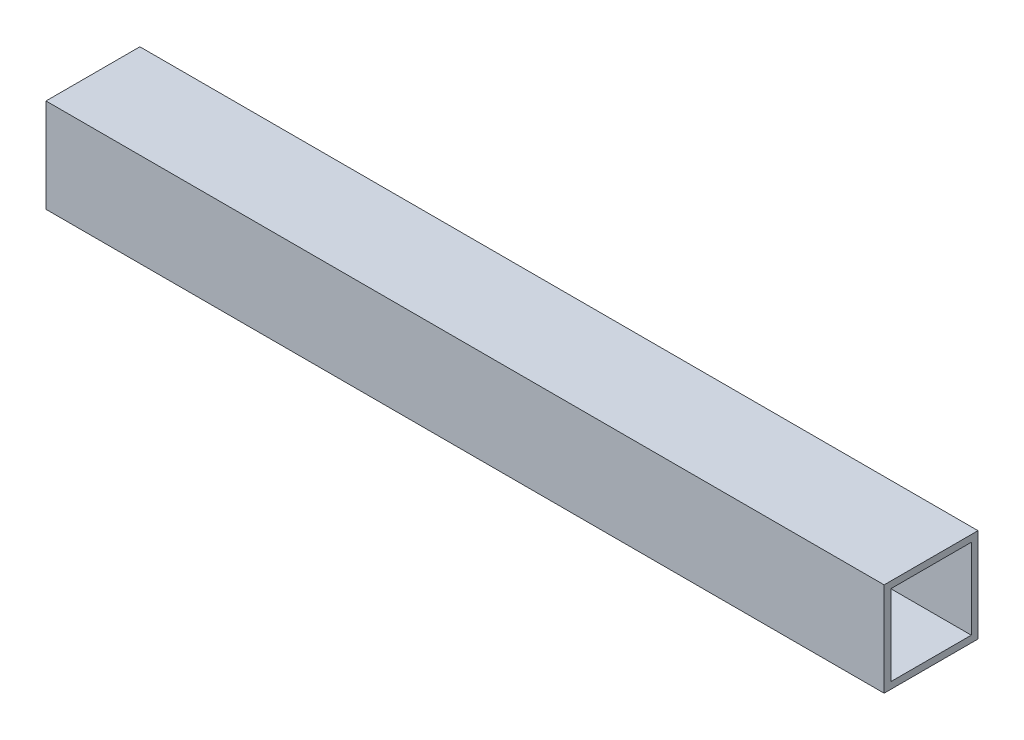
ISO-10303-21;
HEADER;
FILE_DESCRIPTION(('STEP AP214'),'2;1');
FILE_NAME('part.step','',(''),(''),'','','');
FILE_SCHEMA(('AUTOMOTIVE_DESIGN { 1 0 10303 214 1 1 1 1 }'));
ENDSEC;
DATA;
#1=APPLICATION_CONTEXT('core data for automotive mechanical design processes');
#2=APPLICATION_PROTOCOL_DEFINITION('international standard','automotive_design',2000,#1);
#3=PRODUCT_CONTEXT('',#1,'mechanical');
#4=PRODUCT('Part','Part','',(#3));
#5=PRODUCT_RELATED_PRODUCT_CATEGORY('part','',(#4));
#6=PRODUCT_DEFINITION_FORMATION('','',#4);
#7=PRODUCT_DEFINITION_CONTEXT('part definition',#1,'design');
#8=PRODUCT_DEFINITION('design','',#6,#7);
#9=PRODUCT_DEFINITION_SHAPE('','',#8);
#10=(LENGTH_UNIT() NAMED_UNIT(*) SI_UNIT(.MILLI.,.METRE.));
#11=(NAMED_UNIT(*) PLANE_ANGLE_UNIT() SI_UNIT($,.RADIAN.));
#12=(NAMED_UNIT(*) SI_UNIT($,.STERADIAN.) SOLID_ANGLE_UNIT());
#13=UNCERTAINTY_MEASURE_WITH_UNIT(LENGTH_MEASURE(1.E-05),#10,'distance_accuracy_value','');
#14=(GEOMETRIC_REPRESENTATION_CONTEXT(3) GLOBAL_UNCERTAINTY_ASSIGNED_CONTEXT((#13)) GLOBAL_UNIT_ASSIGNED_CONTEXT((#10,
#11,#12)) REPRESENTATION_CONTEXT('',''));
#15=CARTESIAN_POINT('',(0.,0.,0.));
#16=DIRECTION('',(0.,0.,1.));
#17=DIRECTION('',(1.,0.,0.));
#18=AXIS2_PLACEMENT_3D('',#15,#16,#17);
#19=CARTESIAN_POINT('',(461.9625,-793.75,44.45));
#20=DIRECTION('',(0.,-1.,0.));
#21=DIRECTION('',(1.,0.,0.));
#22=AXIS2_PLACEMENT_3D('',#19,#20,#21);
#23=PLANE('',#22);
#24=DIRECTION('',(0.,0.,1.));
#25=VECTOR('',#24,1.);
#26=CARTESIAN_POINT('',(263.525,-793.75,44.45));
#27=LINE('',#26,#25);
#28=CARTESIAN_POINT('',(263.525,-793.75,44.45));
#29=VERTEX_POINT('',#28);
#30=CARTESIAN_POINT('',(263.525,-793.75,0.));
#31=VERTEX_POINT('',#30);
#32=EDGE_CURVE('E131',#29,#31,#27,.F.);
#33=ORIENTED_EDGE('',*,*,#32,.F.);
#34=DIRECTION('',(1.,0.,0.));
#35=VECTOR('',#34,1.);
#36=CARTESIAN_POINT('',(461.9625,-793.75,44.45));
#37=LINE('',#36,#35);
#38=CARTESIAN_POINT('',(660.4,-793.75,44.45));
#39=VERTEX_POINT('',#38);
#40=EDGE_CURVE('E123',#39,#29,#37,.F.);
#41=ORIENTED_EDGE('',*,*,#40,.F.);
#42=DIRECTION('',(0.,0.,1.));
#43=VECTOR('',#42,1.);
#44=CARTESIAN_POINT('',(660.4,-793.75,44.45));
#45=LINE('',#44,#43);
#46=CARTESIAN_POINT('',(660.4,-793.75,0.));
#47=VERTEX_POINT('',#46);
#48=EDGE_CURVE('E108',#39,#47,#45,.F.);
#49=ORIENTED_EDGE('',*,*,#48,.T.);
#50=DIRECTION('',(1.,0.,0.));
#51=VECTOR('',#50,1.);
#52=CARTESIAN_POINT('',(461.9625,-793.75,0.));
#53=LINE('',#52,#51);
#54=EDGE_CURVE('E111',#47,#31,#53,.F.);
#55=ORIENTED_EDGE('',*,*,#54,.T.);
#56=EDGE_LOOP('',(#33,#41,#49,#55));
#57=FACE_BOUND('',#56,.T.);
#58=ADVANCED_FACE('F14',(#57),#23,.F.);
#59=CARTESIAN_POINT('',(461.9625,-835.025,44.45));
#60=DIRECTION('',(0.,-1.,0.));
#61=DIRECTION('',(1.,0.,0.));
#62=AXIS2_PLACEMENT_3D('',#59,#60,#61);
#63=PLANE('',#62);
#64=DIRECTION('',(0.,0.,1.));
#65=VECTOR('',#64,1.);
#66=CARTESIAN_POINT('',(263.525,-835.025,44.45));
#67=LINE('',#66,#65);
#68=CARTESIAN_POINT('',(263.525,-835.025,41.275));
#69=VERTEX_POINT('',#68);
#70=CARTESIAN_POINT('',(263.525,-835.025,3.175));
#71=VERTEX_POINT('',#70);
#72=EDGE_CURVE('E134',#69,#71,#67,.F.);
#73=ORIENTED_EDGE('',*,*,#72,.F.);
#74=DIRECTION('',(1.,0.,0.));
#75=VECTOR('',#74,1.);
#76=CARTESIAN_POINT('',(461.9625,-835.025,41.275));
#77=LINE('',#76,#75);
#78=CARTESIAN_POINT('',(660.4,-835.025,41.275));
#79=VERTEX_POINT('',#78);
#80=EDGE_CURVE('E97',#69,#79,#77,.T.);
#81=ORIENTED_EDGE('',*,*,#80,.T.);
#82=DIRECTION('',(0.,0.,1.));
#83=VECTOR('',#82,1.);
#84=CARTESIAN_POINT('',(660.4,-835.025,44.45));
#85=LINE('',#84,#83);
#86=CARTESIAN_POINT('',(660.4,-835.025,3.175));
#87=VERTEX_POINT('',#86);
#88=EDGE_CURVE('E101',#79,#87,#85,.F.);
#89=ORIENTED_EDGE('',*,*,#88,.T.);
#90=DIRECTION('',(1.,0.,0.));
#91=VECTOR('',#90,1.);
#92=CARTESIAN_POINT('',(461.9625,-835.025,3.175));
#93=LINE('',#92,#91);
#94=EDGE_CURVE('E17',#71,#87,#93,.T.);
#95=ORIENTED_EDGE('',*,*,#94,.F.);
#96=EDGE_LOOP('',(#73,#81,#89,#95));
#97=FACE_BOUND('',#96,.T.);
#98=ADVANCED_FACE('F230',(#97),#63,.F.);
#99=CARTESIAN_POINT('',(461.9625,-815.975,3.175));
#100=DIRECTION('',(0.,0.,1.));
#101=DIRECTION('',(1.,0.,0.));
#102=AXIS2_PLACEMENT_3D('',#99,#100,#101);
#103=PLANE('',#102);
#104=DIRECTION('',(1.,0.,0.));
#105=VECTOR('',#104,1.);
#106=CARTESIAN_POINT('',(461.9625,-796.925,3.175));
#107=LINE('',#106,#105);
#108=CARTESIAN_POINT('',(263.525,-796.925,3.175));
#109=VERTEX_POINT('',#108);
#110=CARTESIAN_POINT('',(660.4,-796.925,3.175));
#111=VERTEX_POINT('',#110);
#112=EDGE_CURVE('E81',#109,#111,#107,.T.);
#113=ORIENTED_EDGE('',*,*,#112,.F.);
#114=DIRECTION('',(0.,1.,0.));
#115=VECTOR('',#114,1.);
#116=CARTESIAN_POINT('',(263.525,-815.975,3.175));
#117=LINE('',#116,#115);
#118=EDGE_CURVE('E118',#71,#109,#117,.T.);
#119=ORIENTED_EDGE('',*,*,#118,.F.);
#120=ORIENTED_EDGE('',*,*,#94,.T.);
#121=DIRECTION('',(0.,1.,0.));
#122=VECTOR('',#121,1.);
#123=CARTESIAN_POINT('',(660.4,-815.975,3.175));
#124=LINE('',#123,#122);
#125=EDGE_CURVE('E103',#87,#111,#124,.T.);
#126=ORIENTED_EDGE('',*,*,#125,.T.);
#127=EDGE_LOOP('',(#113,#119,#120,#126));
#128=FACE_BOUND('',#127,.T.);
#129=ADVANCED_FACE('F116',(#128),#103,.T.);
#130=CARTESIAN_POINT('',(461.9625,-796.925,44.45));
#131=DIRECTION('',(0.,-1.,0.));
#132=DIRECTION('',(1.,0.,0.));
#133=AXIS2_PLACEMENT_3D('',#130,#131,#132);
#134=PLANE('',#133);
#135=DIRECTION('',(1.,0.,0.));
#136=VECTOR('',#135,1.);
#137=CARTESIAN_POINT('',(461.9625,-796.925,41.275));
#138=LINE('',#137,#136);
#139=CARTESIAN_POINT('',(660.4,-796.925,41.275));
#140=VERTEX_POINT('',#139);
#141=CARTESIAN_POINT('',(263.525,-796.925,41.275));
#142=VERTEX_POINT('',#141);
#143=EDGE_CURVE('E79',#140,#142,#138,.F.);
#144=ORIENTED_EDGE('',*,*,#143,.T.);
#145=DIRECTION('',(0.,0.,1.));
#146=VECTOR('',#145,1.);
#147=CARTESIAN_POINT('',(263.525,-796.925,44.45));
#148=LINE('',#147,#146);
#149=EDGE_CURVE('E137',#109,#142,#148,.T.);
#150=ORIENTED_EDGE('',*,*,#149,.F.);
#151=ORIENTED_EDGE('',*,*,#112,.T.);
#152=DIRECTION('',(0.,0.,1.));
#153=VECTOR('',#152,1.);
#154=CARTESIAN_POINT('',(660.4,-796.925,44.45));
#155=LINE('',#154,#153);
#156=EDGE_CURVE('E75',#111,#140,#155,.T.);
#157=ORIENTED_EDGE('',*,*,#156,.T.);
#158=EDGE_LOOP('',(#144,#150,#151,#157));
#159=FACE_BOUND('',#158,.T.);
#160=ADVANCED_FACE('F77',(#159),#134,.T.);
#161=CARTESIAN_POINT('',(461.9625,-815.975,41.275));
#162=DIRECTION('',(0.,0.,1.));
#163=DIRECTION('',(1.,0.,0.));
#164=AXIS2_PLACEMENT_3D('',#161,#162,#163);
#165=PLANE('',#164);
#166=DIRECTION('',(0.,1.,0.));
#167=VECTOR('',#166,1.);
#168=CARTESIAN_POINT('',(263.525,-815.975,41.275));
#169=LINE('',#168,#167);
#170=EDGE_CURVE('E95',#142,#69,#169,.F.);
#171=ORIENTED_EDGE('',*,*,#170,.F.);
#172=ORIENTED_EDGE('',*,*,#143,.F.);
#173=DIRECTION('',(0.,1.,0.));
#174=VECTOR('',#173,1.);
#175=CARTESIAN_POINT('',(660.4,-815.975,41.275));
#176=LINE('',#175,#174);
#177=EDGE_CURVE('E86',#140,#79,#176,.F.);
#178=ORIENTED_EDGE('',*,*,#177,.T.);
#179=ORIENTED_EDGE('',*,*,#80,.F.);
#180=EDGE_LOOP('',(#171,#172,#178,#179));
#181=FACE_BOUND('',#180,.T.);
#182=ADVANCED_FACE('F91',(#181),#165,.F.);
#183=CARTESIAN_POINT('',(461.9625,-815.975,0.));
#184=DIRECTION('',(0.,0.,1.));
#185=DIRECTION('',(1.,0.,0.));
#186=AXIS2_PLACEMENT_3D('',#183,#184,#185);
#187=PLANE('',#186);
#188=DIRECTION('',(0.,1.,0.));
#189=VECTOR('',#188,1.);
#190=CARTESIAN_POINT('',(263.525,-815.975,0.));
#191=LINE('',#190,#189);
#192=CARTESIAN_POINT('',(263.525,-838.2,0.));
#193=VERTEX_POINT('',#192);
#194=EDGE_CURVE('E127',#31,#193,#191,.F.);
#195=ORIENTED_EDGE('',*,*,#194,.F.);
#196=ORIENTED_EDGE('',*,*,#54,.F.);
#197=DIRECTION('',(0.,1.,0.));
#198=VECTOR('',#197,1.);
#199=CARTESIAN_POINT('',(660.4,-815.975,0.));
#200=LINE('',#199,#198);
#201=CARTESIAN_POINT('',(660.4,-838.2,0.));
#202=VERTEX_POINT('',#201);
#203=EDGE_CURVE('E87',#47,#202,#200,.F.);
#204=ORIENTED_EDGE('',*,*,#203,.T.);
#205=DIRECTION('',(1.,0.,0.));
#206=VECTOR('',#205,1.);
#207=CARTESIAN_POINT('',(461.9625,-838.2,0.));
#208=LINE('',#207,#206);
#209=EDGE_CURVE('E140',#193,#202,#208,.T.);
#210=ORIENTED_EDGE('',*,*,#209,.F.);
#211=EDGE_LOOP('',(#195,#196,#204,#210));
#212=FACE_BOUND('',#211,.T.);
#213=ADVANCED_FACE('F160',(#212),#187,.F.);
#214=CARTESIAN_POINT('',(660.4,-815.975,44.45));
#215=DIRECTION('',(-1.,0.,0.));
#216=DIRECTION('',(0.,0.,1.));
#217=AXIS2_PLACEMENT_3D('',#214,#215,#216);
#218=PLANE('',#217);
#219=ORIENTED_EDGE('',*,*,#88,.F.);
#220=ORIENTED_EDGE('',*,*,#177,.F.);
#221=ORIENTED_EDGE('',*,*,#156,.F.);
#222=ORIENTED_EDGE('',*,*,#125,.F.);
#223=EDGE_LOOP('',(#219,#220,#221,#222));
#224=FACE_BOUND('',#223,.T.);
#225=ORIENTED_EDGE('',*,*,#48,.F.);
#226=DIRECTION('',(0.,1.,0.));
#227=VECTOR('',#226,1.);
#228=CARTESIAN_POINT('',(660.4,-815.975,44.45));
#229=LINE('',#228,#227);
#230=CARTESIAN_POINT('',(660.4,-838.2,44.45));
#231=VERTEX_POINT('',#230);
#232=EDGE_CURVE('E121',#231,#39,#229,.T.);
#233=ORIENTED_EDGE('',*,*,#232,.F.);
#234=DIRECTION('',(0.,0.,1.));
#235=VECTOR('',#234,1.);
#236=CARTESIAN_POINT('',(660.4,-838.2,44.45));
#237=LINE('',#236,#235);
#238=EDGE_CURVE('E143',#202,#231,#237,.T.);
#239=ORIENTED_EDGE('',*,*,#238,.F.);
#240=ORIENTED_EDGE('',*,*,#203,.F.);
#241=EDGE_LOOP('',(#225,#233,#239,#240));
#242=FACE_BOUND('',#241,.T.);
#243=ADVANCED_FACE('F99',(#224,#242),#218,.F.);
#244=CARTESIAN_POINT('',(461.9625,-815.975,44.45));
#245=DIRECTION('',(0.,0.,1.));
#246=DIRECTION('',(1.,0.,0.));
#247=AXIS2_PLACEMENT_3D('',#244,#245,#246);
#248=PLANE('',#247);
#249=ORIENTED_EDGE('',*,*,#40,.T.);
#250=DIRECTION('',(0.,1.,0.));
#251=VECTOR('',#250,1.);
#252=CARTESIAN_POINT('',(263.525,-815.975,44.45));
#253=LINE('',#252,#251);
#254=CARTESIAN_POINT('',(263.525,-838.2,44.45));
#255=VERTEX_POINT('',#254);
#256=EDGE_CURVE('E32',#255,#29,#253,.T.);
#257=ORIENTED_EDGE('',*,*,#256,.F.);
#258=DIRECTION('',(1.,0.,0.));
#259=VECTOR('',#258,1.);
#260=CARTESIAN_POINT('',(461.9625,-838.2,44.45));
#261=LINE('',#260,#259);
#262=EDGE_CURVE('E23',#231,#255,#261,.F.);
#263=ORIENTED_EDGE('',*,*,#262,.F.);
#264=ORIENTED_EDGE('',*,*,#232,.T.);
#265=EDGE_LOOP('',(#249,#257,#263,#264));
#266=FACE_BOUND('',#265,.T.);
#267=ADVANCED_FACE('F150',(#266),#248,.T.);
#268=CARTESIAN_POINT('',(263.525,-815.975,44.45));
#269=DIRECTION('',(-1.,0.,0.));
#270=DIRECTION('',(0.,0.,1.));
#271=AXIS2_PLACEMENT_3D('',#268,#269,#270);
#272=PLANE('',#271);
#273=ORIENTED_EDGE('',*,*,#149,.T.);
#274=ORIENTED_EDGE('',*,*,#170,.T.);
#275=ORIENTED_EDGE('',*,*,#72,.T.);
#276=ORIENTED_EDGE('',*,*,#118,.T.);
#277=EDGE_LOOP('',(#273,#274,#275,#276));
#278=FACE_BOUND('',#277,.T.);
#279=ORIENTED_EDGE('',*,*,#256,.T.);
#280=ORIENTED_EDGE('',*,*,#32,.T.);
#281=ORIENTED_EDGE('',*,*,#194,.T.);
#282=DIRECTION('',(0.,0.,1.));
#283=VECTOR('',#282,1.);
#284=CARTESIAN_POINT('',(263.525,-838.2,44.45));
#285=LINE('',#284,#283);
#286=EDGE_CURVE('E9',#255,#193,#285,.F.);
#287=ORIENTED_EDGE('',*,*,#286,.F.);
#288=EDGE_LOOP('',(#279,#280,#281,#287));
#289=FACE_BOUND('',#288,.T.);
#290=ADVANCED_FACE('F158',(#278,#289),#272,.T.);
#291=CARTESIAN_POINT('',(461.9625,-838.2,44.45));
#292=DIRECTION('',(0.,-1.,0.));
#293=DIRECTION('',(1.,0.,0.));
#294=AXIS2_PLACEMENT_3D('',#291,#292,#293);
#295=PLANE('',#294);
#296=ORIENTED_EDGE('',*,*,#262,.T.);
#297=ORIENTED_EDGE('',*,*,#286,.T.);
#298=ORIENTED_EDGE('',*,*,#209,.T.);
#299=ORIENTED_EDGE('',*,*,#238,.T.);
#300=EDGE_LOOP('',(#296,#297,#298,#299));
#301=FACE_BOUND('',#300,.T.);
#302=ADVANCED_FACE('F148',(#301),#295,.T.);
#303=CLOSED_SHELL('',(#58,#98,#129,#160,#182,#213,#243,#267,#290,#302));
#304=MANIFOLD_SOLID_BREP('B1',#303);
#305=ADVANCED_BREP_SHAPE_REPRESENTATION('',(#18,#304),#14);
#306=SHAPE_DEFINITION_REPRESENTATION(#9,#305);
ENDSEC;
END-ISO-10303-21;
